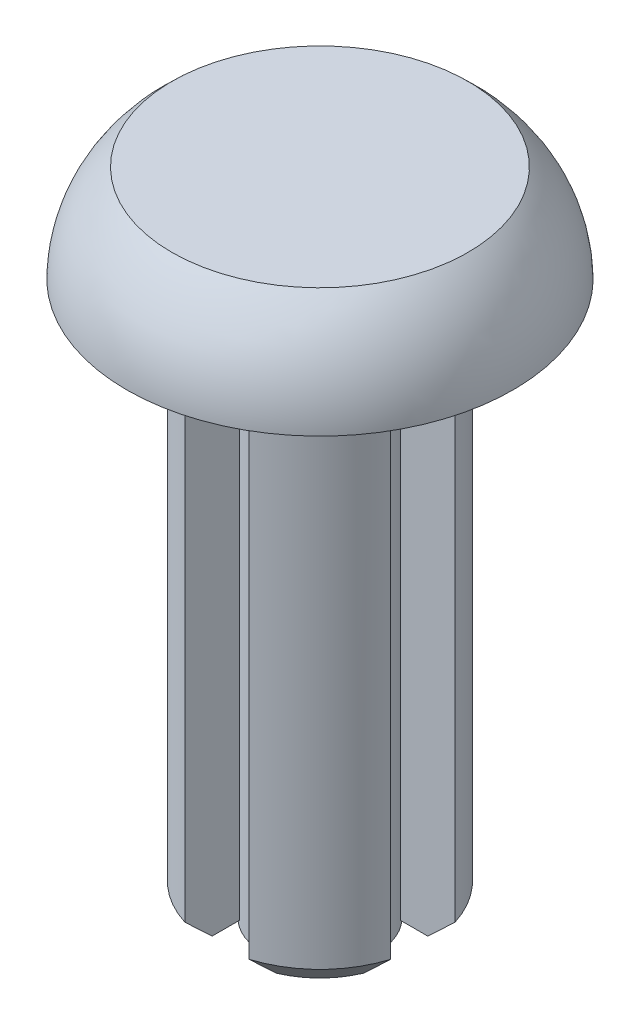
ISO-10303-21;
HEADER;
FILE_DESCRIPTION(('STEP AP214'),'2;1');
FILE_NAME('part.step','',(''),(''),'','','');
FILE_SCHEMA(('AUTOMOTIVE_DESIGN { 1 0 10303 214 1 1 1 1 }'));
ENDSEC;
DATA;
#1=APPLICATION_CONTEXT('core data for automotive mechanical design processes');
#2=APPLICATION_PROTOCOL_DEFINITION('international standard','automotive_design',2000,#1);
#3=PRODUCT_CONTEXT('',#1,'mechanical');
#4=PRODUCT('Part','Part','',(#3));
#5=PRODUCT_RELATED_PRODUCT_CATEGORY('part','',(#4));
#6=PRODUCT_DEFINITION_FORMATION('','',#4);
#7=PRODUCT_DEFINITION_CONTEXT('part definition',#1,'design');
#8=PRODUCT_DEFINITION('design','',#6,#7);
#9=PRODUCT_DEFINITION_SHAPE('','',#8);
#10=(LENGTH_UNIT() NAMED_UNIT(*) SI_UNIT(.MILLI.,.METRE.));
#11=(NAMED_UNIT(*) PLANE_ANGLE_UNIT() SI_UNIT($,.RADIAN.));
#12=(NAMED_UNIT(*) SI_UNIT($,.STERADIAN.) SOLID_ANGLE_UNIT());
#13=UNCERTAINTY_MEASURE_WITH_UNIT(LENGTH_MEASURE(1.E-05),#10,'distance_accuracy_value','');
#14=(GEOMETRIC_REPRESENTATION_CONTEXT(3) GLOBAL_UNCERTAINTY_ASSIGNED_CONTEXT((#13)) GLOBAL_UNIT_ASSIGNED_CONTEXT((#10,
#11,#12)) REPRESENTATION_CONTEXT('',''));
#15=CARTESIAN_POINT('',(0.,0.,0.));
#16=DIRECTION('',(0.,0.,1.));
#17=DIRECTION('',(1.,0.,0.));
#18=AXIS2_PLACEMENT_3D('',#15,#16,#17);
#19=CARTESIAN_POINT('',(0.,1.905,0.));
#20=DIRECTION('',(0.,1.,0.));
#21=DIRECTION('',(0.,0.,1.));
#22=AXIS2_PLACEMENT_3D('',#19,#20,#21);
#23=PLANE('',#22);
#24=CARTESIAN_POINT('',(0.,1.905,0.));
#25=DIRECTION('',(0.,1.,0.));
#26=DIRECTION('',(0.,0.,1.));
#27=AXIS2_PLACEMENT_3D('',#24,#25,#26);
#28=CIRCLE('',#27,2.921);
#29=CARTESIAN_POINT('',(0.,1.905,2.921));
#30=VERTEX_POINT('',#29);
#31=EDGE_CURVE('E21',#30,#30,#28,.F.);
#32=ORIENTED_EDGE('',*,*,#31,.F.);
#33=EDGE_LOOP('',(#32));
#34=FACE_BOUND('',#33,.T.);
#35=ADVANCED_FACE('F17',(#34),#23,.T.);
#36=CARTESIAN_POINT('',(0.,-11.4394,0.));
#37=DIRECTION('',(0.,-1.,0.));
#38=DIRECTION('',(0.,0.,-1.));
#39=AXIS2_PLACEMENT_3D('',#36,#37,#38);
#40=PLANE('',#39);
#41=CARTESIAN_POINT('',(0.,-11.4393999999152,0.));
#42=DIRECTION('',(0.,1.,0.));
#43=DIRECTION('',(0.,0.,1.));
#44=AXIS2_PLACEMENT_3D('',#41,#42,#43);
#45=CIRCLE('',#44,0.634999999988395);
#46=CARTESIAN_POINT('',(0.,-11.4393999999152,0.634999999988395));
#47=VERTEX_POINT('',#46);
#48=EDGE_CURVE('E174',#47,#47,#45,.T.);
#49=ORIENTED_EDGE('',*,*,#48,.F.);
#50=EDGE_LOOP('',(#49));
#51=FACE_BOUND('',#50,.T.);
#52=ADVANCED_FACE('F355',(#51),#40,.T.);
#53=CARTESIAN_POINT('',(0.,-10.8044,0.));
#54=DIRECTION('',(0.,-1.,0.));
#55=DIRECTION('',(0.,0.,-1.));
#56=AXIS2_PLACEMENT_3D('',#53,#54,#55);
#57=PLANE('',#56);
#58=DIRECTION('',(1.,0.,0.));
#59=VECTOR('',#58,1.);
#60=CARTESIAN_POINT('',(0.635,-10.8044,0.635));
#61=LINE('',#60,#59);
#62=CARTESIAN_POINT('',(0.950380976240581,-10.8044,0.635));
#63=VERTEX_POINT('',#62);
#64=CARTESIAN_POINT('',(1.48954542139407,-10.8043999999918,0.635));
#65=VERTEX_POINT('',#64);
#66=EDGE_CURVE('E189',#63,#65,#61,.T.);
#67=ORIENTED_EDGE('',*,*,#66,.T.);
#68=CARTESIAN_POINT('',(0.,-10.8043999999836,0.));
#69=DIRECTION('',(0.,1.,0.));
#70=DIRECTION('',(0.,0.,1.));
#71=AXIS2_PLACEMENT_3D('',#68,#69,#70);
#72=CIRCLE('',#71,1.61924999997609);
#73=CARTESIAN_POINT('',(0.635000000000001,-10.8043999999877,1.48954542139852));
#74=VERTEX_POINT('',#73);
#75=EDGE_CURVE('E190',#74,#65,#72,.T.);
#76=ORIENTED_EDGE('',*,*,#75,.F.);
#77=DIRECTION('',(0.,0.,-1.));
#78=VECTOR('',#77,1.);
#79=CARTESIAN_POINT('',(0.635000000000001,-10.8043999999918,2.03026292940102));
#80=LINE('',#79,#78);
#81=CARTESIAN_POINT('',(0.635,-10.8043999999959,0.950380976240581));
#82=VERTEX_POINT('',#81);
#83=EDGE_CURVE('E194',#74,#82,#80,.T.);
#84=ORIENTED_EDGE('',*,*,#83,.T.);
#85=CARTESIAN_POINT('',(0.,-10.8044,0.));
#86=DIRECTION('',(0.,1.,0.));
#87=DIRECTION('',(0.,0.,1.));
#88=AXIS2_PLACEMENT_3D('',#85,#86,#87);
#89=CIRCLE('',#88,1.143);
#90=EDGE_CURVE('E173',#63,#82,#89,.F.);
#91=ORIENTED_EDGE('',*,*,#90,.F.);
#92=EDGE_LOOP('',(#67,#76,#84,#91));
#93=FACE_BOUND('',#92,.T.);
#94=ADVANCED_FACE('F361',(#93),#57,.T.);
#95=CARTESIAN_POINT('',(0.,-10.8044,0.));
#96=DIRECTION('',(0.,-1.,0.));
#97=DIRECTION('',(0.,0.,-1.));
#98=AXIS2_PLACEMENT_3D('',#95,#96,#97);
#99=PLANE('',#98);
#100=DIRECTION('',(0.,0.,-1.));
#101=VECTOR('',#100,1.);
#102=CARTESIAN_POINT('',(0.635,-10.8044,-0.635));
#103=LINE('',#102,#101);
#104=CARTESIAN_POINT('',(0.635,-10.8044,-0.950380976240581));
#105=VERTEX_POINT('',#104);
#106=CARTESIAN_POINT('',(0.635000000000001,-10.8044000000202,-1.48954542130138));
#107=VERTEX_POINT('',#106);
#108=EDGE_CURVE('E300',#105,#107,#103,.T.);
#109=ORIENTED_EDGE('',*,*,#108,.T.);
#110=CARTESIAN_POINT('',(0.,-10.8044000000405,0.));
#111=DIRECTION('',(0.,1.,0.));
#112=DIRECTION('',(0.,0.,1.));
#113=AXIS2_PLACEMENT_3D('',#110,#111,#112);
#114=CIRCLE('',#113,1.6192499998624);
#115=CARTESIAN_POINT('',(1.48954542130583,-10.8044000000161,-0.635));
#116=VERTEX_POINT('',#115);
#117=EDGE_CURVE('E158',#116,#107,#114,.T.);
#118=ORIENTED_EDGE('',*,*,#117,.F.);
#119=DIRECTION('',(-1.,0.,0.));
#120=VECTOR('',#119,1.);
#121=CARTESIAN_POINT('',(0.635,-10.8043999999918,-0.635));
#122=LINE('',#121,#120);
#123=CARTESIAN_POINT('',(0.950380976240581,-10.8043999999959,-0.635));
#124=VERTEX_POINT('',#123);
#125=EDGE_CURVE('E152',#116,#124,#122,.T.);
#126=ORIENTED_EDGE('',*,*,#125,.T.);
#127=CARTESIAN_POINT('',(0.,-10.8044,0.));
#128=DIRECTION('',(0.,1.,0.));
#129=DIRECTION('',(0.,0.,1.));
#130=AXIS2_PLACEMENT_3D('',#127,#128,#129);
#131=CIRCLE('',#130,1.143);
#132=EDGE_CURVE('E155',#105,#124,#131,.F.);
#133=ORIENTED_EDGE('',*,*,#132,.F.);
#134=EDGE_LOOP('',(#109,#118,#126,#133));
#135=FACE_BOUND('',#134,.T.);
#136=ADVANCED_FACE('F154',(#135),#99,.T.);
#137=CARTESIAN_POINT('',(0.,-0.0595861521909713,0.));
#138=DIRECTION('',(0.,1.,0.));
#139=DIRECTION('',(0.,0.,1.));
#140=AXIS2_PLACEMENT_3D('',#137,#138,#139);
#141=DEGENERATE_TOROIDAL_SURFACE('',#140,1.19674395959077,2.61393527889813,.T.);
#142=ORIENTED_EDGE('',*,*,#31,.T.);
#143=EDGE_LOOP('',(#142));
#144=FACE_BOUND('',#143,.T.);
#145=CARTESIAN_POINT('',(0.,-1.77635683940025E-12,0.));
#146=DIRECTION('',(0.,1.,0.));
#147=DIRECTION('',(0.,0.,1.));
#148=AXIS2_PLACEMENT_3D('',#145,#146,#147);
#149=CIRCLE('',#148,3.80999999993037);
#150=CARTESIAN_POINT('',(0.,-1.77635683940025E-12,3.80999999993037));
#151=VERTEX_POINT('',#150);
#152=EDGE_CURVE('E299',#151,#151,#149,.F.);
#153=ORIENTED_EDGE('',*,*,#152,.F.);
#154=EDGE_LOOP('',(#153));
#155=FACE_BOUND('',#154,.T.);
#156=ADVANCED_FACE('F351',(#144,#155),#141,.T.);
#157=CARTESIAN_POINT('',(0.,-10.9314000000609,0.));
#158=DIRECTION('',(0.,1.,0.));
#159=DIRECTION('',(0.,0.,1.));
#160=AXIS2_PLACEMENT_3D('',#157,#158,#159);
#161=CONICAL_SURFACE('',#160,1.14299999984269,0.785398163397448);
#162=ORIENTED_EDGE('',*,*,#48,.T.);
#163=EDGE_LOOP('',(#162));
#164=FACE_BOUND('',#163,.T.);
#165=CARTESIAN_POINT('',(0.,-10.9314,0.));
#166=DIRECTION('',(0.,1.,0.));
#167=DIRECTION('',(0.,0.,1.));
#168=AXIS2_PLACEMENT_3D('',#165,#166,#167);
#169=CIRCLE('',#168,1.143);
#170=CARTESIAN_POINT('',(0.,-10.9314,1.143));
#171=VERTEX_POINT('',#170);
#172=EDGE_CURVE('E291',#171,#171,#169,.T.);
#173=ORIENTED_EDGE('',*,*,#172,.F.);
#174=EDGE_LOOP('',(#173));
#175=FACE_BOUND('',#174,.T.);
#176=ADVANCED_FACE('F398',(#164,#175),#161,.T.);
#177=CARTESIAN_POINT('',(0.635000000000001,-0.644399999999998,2.03026292940102));
#178=DIRECTION('',(1.,0.,0.));
#179=DIRECTION('',(0.,0.,-1.));
#180=AXIS2_PLACEMENT_3D('',#177,#178,#179);
#181=PLANE('',#180);
#182=DIRECTION('',(0.,1.,0.));
#183=VECTOR('',#182,1.);
#184=CARTESIAN_POINT('',(0.635000000000001,-10.8044,2.03026292940102));
#185=LINE('',#184,#183);
#186=CARTESIAN_POINT('',(0.635000000000001,-0.644399999999998,2.03026292940102));
#187=VERTEX_POINT('',#186);
#188=CARTESIAN_POINT('',(0.635000000000001,-10.2963999999786,2.0302629293955));
#189=VERTEX_POINT('',#188);
#190=EDGE_CURVE('E285',#187,#189,#185,.F.);
#191=ORIENTED_EDGE('',*,*,#190,.F.);
#192=DIRECTION('',(0.,0.,-1.));
#193=VECTOR('',#192,1.);
#194=CARTESIAN_POINT('',(0.635000000000001,-0.644399999999998,2.03026292940102));
#195=LINE('',#194,#193);
#196=CARTESIAN_POINT('',(0.635,-0.644399999999998,0.950380976240581));
#197=VERTEX_POINT('',#196);
#198=EDGE_CURVE('E193',#197,#187,#195,.F.);
#199=ORIENTED_EDGE('',*,*,#198,.F.);
#200=DIRECTION('',(0.,1.,0.));
#201=VECTOR('',#200,1.);
#202=CARTESIAN_POINT('',(0.635,-0.644399999999998,0.950380976240581));
#203=LINE('',#202,#201);
#204=EDGE_CURVE('E191',#82,#197,#203,.T.);
#205=ORIENTED_EDGE('',*,*,#204,.F.);
#206=ORIENTED_EDGE('',*,*,#83,.F.);
#207=CARTESIAN_POINT('',(0.635000000000001,-10.2963999999702,2.03026292938998));
#208=CARTESIAN_POINT('',(0.635000000000001,-10.3390858324227,1.98553535088397));
#209=CARTESIAN_POINT('',(0.635000000000001,-10.3817085821711,1.94074736694316));
#210=CARTESIAN_POINT('',(0.635000000000001,-10.4667920637127,1.85101953980214));
#211=CARTESIAN_POINT('',(0.635000000000001,-10.5092527987846,1.80607969971006));
#212=CARTESIAN_POINT('',(0.635000000000001,-10.5939784631017,1.71601494909392));
#213=CARTESIAN_POINT('',(0.635000000000001,-10.6362433908426,1.67089003715297));
#214=CARTESIAN_POINT('',(0.635000000000001,-10.720523173935,1.58040565286933));
#215=CARTESIAN_POINT('',(0.635000000000001,-10.7625380241531,1.53504617574705));
#216=CARTESIAN_POINT('',(0.635000000000001,-10.8043999999896,1.48954542139652));
#217=B_SPLINE_CURVE_WITH_KNOTS('',3,(#207,#208,#209,#210,#211,#212,#213,#214,#215,#216),
.UNSPECIFIED.,.F.,.F.,(4,2,2,2,4),(0.,0.185482565150804,0.370961356629227,0.556441570759836,
0.741925579312719),.UNSPECIFIED.);
#218=EDGE_CURVE('E338',#189,#74,#217,.T.);
#219=ORIENTED_EDGE('',*,*,#218,.F.);
#220=EDGE_LOOP('',(#191,#199,#205,#206,#219));
#221=FACE_BOUND('',#220,.T.);
#222=ADVANCED_FACE('F333',(#221),#181,.F.);
#223=CARTESIAN_POINT('',(0.,-10.2964000000156,0.));
#224=DIRECTION('',(0.,1.,0.));
#225=DIRECTION('',(0.,0.,1.));
#226=AXIS2_PLACEMENT_3D('',#223,#224,#225);
#227=CONICAL_SURFACE('',#226,2.12724999994407,0.785398163397448);
#228=CARTESIAN_POINT('',(1.48954542139489,-10.8043999999911,0.635));
#229=CARTESIAN_POINT('',(1.53504617574504,-10.762538024155,0.635));
#230=CARTESIAN_POINT('',(1.58040565286695,-10.7205231739372,0.635));
#231=CARTESIAN_POINT('',(1.67089003714985,-10.6362433908455,0.635));
#232=CARTESIAN_POINT('',(1.71601494909043,-10.5939784631049,0.635));
#233=CARTESIAN_POINT('',(1.80607969970584,-10.5092527987886,0.635));
#234=CARTESIAN_POINT('',(1.85101953979754,-10.4667920637171,0.635));
#235=CARTESIAN_POINT('',(1.94074736693783,-10.3817085821762,0.635));
#236=CARTESIAN_POINT('',(1.98553535087827,-10.3390858324281,0.635));
#237=CARTESIAN_POINT('',(2.03026292938392,-10.296399999976,0.635));
#238=B_SPLINE_CURVE_WITH_KNOTS('',3,(#228,#229,#230,#231,#232,#233,#234,#235,#236,#237),
.UNSPECIFIED.,.F.,.F.,(4,2,2,2,4),(0.,0.185484008551341,0.37096422268041,0.55644301415729,
0.741925579306553),.UNSPECIFIED.);
#239=CARTESIAN_POINT('',(2.03026292939202,-10.2963999999815,0.635000000001433));
#240=VERTEX_POINT('',#239);
#241=EDGE_CURVE('E319',#65,#240,#238,.T.);
#242=ORIENTED_EDGE('',*,*,#241,.T.);
#243=CARTESIAN_POINT('',(0.,-10.296399999987,0.));
#244=DIRECTION('',(0.,1.,0.));
#245=DIRECTION('',(0.,0.,1.));
#246=AXIS2_PLACEMENT_3D('',#243,#244,#245);
#247=CIRCLE('',#246,2.12725);
#248=EDGE_CURVE('E423',#189,#240,#247,.T.);
#249=ORIENTED_EDGE('',*,*,#248,.F.);
#250=ORIENTED_EDGE('',*,*,#218,.T.);
#251=ORIENTED_EDGE('',*,*,#75,.T.);
#252=EDGE_LOOP('',(#242,#249,#250,#251));
#253=FACE_BOUND('',#252,.T.);
#254=ADVANCED_FACE('F329',(#253),#227,.T.);
#255=CARTESIAN_POINT('',(0.635,-0.644399999999998,0.635));
#256=DIRECTION('',(0.,0.,1.));
#257=DIRECTION('',(1.,0.,0.));
#258=AXIS2_PLACEMENT_3D('',#255,#256,#257);
#259=PLANE('',#258);
#260=ORIENTED_EDGE('',*,*,#66,.F.);
#261=DIRECTION('',(0.,1.,0.));
#262=VECTOR('',#261,1.);
#263=CARTESIAN_POINT('',(0.950380976240581,-0.644399999999998,0.635));
#264=LINE('',#263,#262);
#265=CARTESIAN_POINT('',(0.950380976240581,-0.644399999999998,0.635));
#266=VERTEX_POINT('',#265);
#267=EDGE_CURVE('E186',#266,#63,#264,.F.);
#268=ORIENTED_EDGE('',*,*,#267,.F.);
#269=DIRECTION('',(1.,0.,0.));
#270=VECTOR('',#269,1.);
#271=CARTESIAN_POINT('',(0.,-0.644399999999998,0.635));
#272=LINE('',#271,#270);
#273=CARTESIAN_POINT('',(2.03026292940057,-0.644399999999998,0.635000000001433));
#274=VERTEX_POINT('',#273);
#275=EDGE_CURVE('E318',#274,#266,#272,.F.);
#276=ORIENTED_EDGE('',*,*,#275,.F.);
#277=DIRECTION('',(0.,1.,0.));
#278=VECTOR('',#277,1.);
#279=CARTESIAN_POINT('',(2.03026292940012,-10.8044,0.635000000002867));
#280=LINE('',#279,#278);
#281=EDGE_CURVE('E281',#240,#274,#280,.T.);
#282=ORIENTED_EDGE('',*,*,#281,.F.);
#283=ORIENTED_EDGE('',*,*,#241,.F.);
#284=EDGE_LOOP('',(#260,#268,#276,#282,#283));
#285=FACE_BOUND('',#284,.T.);
#286=ADVANCED_FACE('F327',(#285),#259,.F.);
#287=CARTESIAN_POINT('',(0.,-0.644399999999998,0.));
#288=DIRECTION('',(0.,-1.,0.));
#289=DIRECTION('',(0.,0.,-1.));
#290=AXIS2_PLACEMENT_3D('',#287,#288,#289);
#291=PLANE('',#290);
#292=ORIENTED_EDGE('',*,*,#275,.T.);
#293=CARTESIAN_POINT('',(0.,-0.644399999999998,0.));
#294=DIRECTION('',(0.,1.,0.));
#295=DIRECTION('',(0.,0.,1.));
#296=AXIS2_PLACEMENT_3D('',#293,#294,#295);
#297=CIRCLE('',#296,1.143);
#298=CARTESIAN_POINT('',(0.950380976240581,-0.644399999999998,-0.635));
#299=VERTEX_POINT('',#298);
#300=EDGE_CURVE('E163',#266,#299,#297,.T.);
#301=ORIENTED_EDGE('',*,*,#300,.T.);
#302=DIRECTION('',(-1.,0.,0.));
#303=VECTOR('',#302,1.);
#304=CARTESIAN_POINT('',(0.635,-0.644399999999998,-0.635));
#305=LINE('',#304,#303);
#306=CARTESIAN_POINT('',(2.03026292940102,-0.644399999999998,-0.635));
#307=VERTEX_POINT('',#306);
#308=EDGE_CURVE('E179',#299,#307,#305,.F.);
#309=ORIENTED_EDGE('',*,*,#308,.T.);
#310=CARTESIAN_POINT('',(0.,-0.644399999999998,0.));
#311=DIRECTION('',(0.,1.,0.));
#312=DIRECTION('',(0.,0.,1.));
#313=AXIS2_PLACEMENT_3D('',#310,#311,#312);
#314=CIRCLE('',#313,2.12725);
#315=EDGE_CURVE('E277',#274,#307,#314,.T.);
#316=ORIENTED_EDGE('',*,*,#315,.F.);
#317=EDGE_LOOP('',(#292,#301,#309,#316));
#318=FACE_BOUND('',#317,.T.);
#319=ADVANCED_FACE('F508',(#318),#291,.T.);
#320=CARTESIAN_POINT('',(0.635,-0.644399999999998,-0.635));
#321=DIRECTION('',(0.,0.,-1.));
#322=DIRECTION('',(-1.,0.,0.));
#323=AXIS2_PLACEMENT_3D('',#320,#321,#322);
#324=PLANE('',#323);
#325=DIRECTION('',(0.,1.,0.));
#326=VECTOR('',#325,1.);
#327=CARTESIAN_POINT('',(2.03026292940102,-10.8044,-0.635));
#328=LINE('',#327,#326);
#329=CARTESIAN_POINT('',(2.03026292938663,-10.2963999999512,-0.635));
#330=VERTEX_POINT('',#329);
#331=EDGE_CURVE('E280',#307,#330,#328,.F.);
#332=ORIENTED_EDGE('',*,*,#331,.F.);
#333=ORIENTED_EDGE('',*,*,#308,.F.);
#334=DIRECTION('',(0.,1.,0.));
#335=VECTOR('',#334,1.);
#336=CARTESIAN_POINT('',(0.950380976240581,-0.644399999999998,-0.635));
#337=LINE('',#336,#335);
#338=EDGE_CURVE('E162',#124,#299,#337,.T.);
#339=ORIENTED_EDGE('',*,*,#338,.F.);
#340=ORIENTED_EDGE('',*,*,#125,.F.);
#341=CARTESIAN_POINT('',(2.03026292937224,-10.2963999999303,-0.635));
#342=CARTESIAN_POINT('',(1.98553535086077,-10.3390858323879,-0.635));
#343=CARTESIAN_POINT('',(1.94074736691449,-10.3817085821415,-0.635));
#344=CARTESIAN_POINT('',(1.85101953976248,-10.4667920636934,-0.635));
#345=CARTESIAN_POINT('',(1.80607969966489,-10.5092527987704,-0.635));
#346=CARTESIAN_POINT('',(1.71601494903765,-10.5939784630976,-0.635));
#347=CARTESIAN_POINT('',(1.67089003709113,-10.6362433908435,-0.635));
#348=CARTESIAN_POINT('',(1.58040565279625,-10.720523173946,-0.635));
#349=CARTESIAN_POINT('',(1.53504617566831,-10.7625380241691,-0.635));
#350=CARTESIAN_POINT('',(1.48954542131207,-10.8044000000104,-0.635));
#351=B_SPLINE_CURVE_WITH_KNOTS('',3,(#341,#342,#343,#344,#345,#346,#347,#348,#349,#350),
.UNSPECIFIED.,.F.,.F.,(4,2,2,2,4),(0.,0.185482565173361,0.370961356674336,0.5564415708275,
0.741925579402941),.UNSPECIFIED.);
#352=EDGE_CURVE('E181',#330,#116,#351,.T.);
#353=ORIENTED_EDGE('',*,*,#352,.F.);
#354=EDGE_LOOP('',(#332,#333,#339,#340,#353));
#355=FACE_BOUND('',#354,.T.);
#356=ADVANCED_FACE('F178',(#355),#324,.F.);
#357=CARTESIAN_POINT('',(0.,-10.2963999999588,0.));
#358=DIRECTION('',(0.,1.,0.));
#359=DIRECTION('',(0.,0.,1.));
#360=AXIS2_PLACEMENT_3D('',#357,#358,#359);
#361=CONICAL_SURFACE('',#360,2.12724999994407,0.785398163397448);
#362=CARTESIAN_POINT('',(0.635000000000001,-10.8044000000015,-1.48954542132177));
#363=CARTESIAN_POINT('',(0.635000000000001,-10.7625380241619,-1.53504617567605));
#364=CARTESIAN_POINT('',(0.635000000000001,-10.7205231739406,-1.58040565280204));
#365=CARTESIAN_POINT('',(0.635000000000001,-10.6362433908417,-1.67089003709305));
#366=CARTESIAN_POINT('',(0.635000000000001,-10.5939784630976,-1.71601494903765));
#367=CARTESIAN_POINT('',(0.635000000000001,-10.509252798774,-1.80607969966106));
#368=CARTESIAN_POINT('',(0.635000000000001,-10.4667920636988,-1.85101953975675));
#369=CARTESIAN_POINT('',(0.635000000000001,-10.3817085821506,-1.94074736690495));
#370=CARTESIAN_POINT('',(0.635000000000001,-10.3390858323988,-1.98553535084933));
#371=CARTESIAN_POINT('',(0.635000000000001,-10.2963999999431,-2.03026292935891));
#372=B_SPLINE_CURVE_WITH_KNOTS('',3,(#362,#363,#364,#365,#366,#367,#368,#369,#370,#371),
.UNSPECIFIED.,.F.,.F.,(4,2,2,2,4),(0.,0.185484008567538,0.370964222712802,0.556443014205879,
0.74192557937134),.UNSPECIFIED.);
#373=CARTESIAN_POINT('',(0.635000000003457,-10.2963999999576,-2.03026292937888));
#374=VERTEX_POINT('',#373);
#375=EDGE_CURVE('E292',#107,#374,#372,.T.);
#376=ORIENTED_EDGE('',*,*,#375,.T.);
#377=CARTESIAN_POINT('',(0.,-10.2963999999721,0.));
#378=DIRECTION('',(0.,1.,0.));
#379=DIRECTION('',(0.,0.,1.));
#380=AXIS2_PLACEMENT_3D('',#377,#378,#379);
#381=CIRCLE('',#380,2.12725);
#382=EDGE_CURVE('E430',#330,#374,#381,.T.);
#383=ORIENTED_EDGE('',*,*,#382,.F.);
#384=ORIENTED_EDGE('',*,*,#352,.T.);
#385=ORIENTED_EDGE('',*,*,#117,.T.);
#386=EDGE_LOOP('',(#376,#383,#384,#385));
#387=FACE_BOUND('',#386,.T.);
#388=ADVANCED_FACE('F305',(#387),#361,.T.);
#389=CARTESIAN_POINT('',(0.635,-0.644399999999998,-0.635));
#390=DIRECTION('',(1.,0.,0.));
#391=DIRECTION('',(0.,0.,-1.));
#392=AXIS2_PLACEMENT_3D('',#389,#390,#391);
#393=PLANE('',#392);
#394=ORIENTED_EDGE('',*,*,#108,.F.);
#395=DIRECTION('',(0.,1.,0.));
#396=VECTOR('',#395,1.);
#397=CARTESIAN_POINT('',(0.635,-0.644399999999998,-0.950380976240581));
#398=LINE('',#397,#396);
#399=CARTESIAN_POINT('',(0.635,-0.644399999999998,-0.950380976240581));
#400=VERTEX_POINT('',#399);
#401=EDGE_CURVE('E171',#400,#105,#398,.F.);
#402=ORIENTED_EDGE('',*,*,#401,.F.);
#403=DIRECTION('',(0.,0.,-1.));
#404=VECTOR('',#403,1.);
#405=CARTESIAN_POINT('',(0.635,-0.644399999999998,-0.635));
#406=LINE('',#405,#404);
#407=CARTESIAN_POINT('',(0.635000000003457,-0.644399999999998,-2.03026292939994));
#408=VERTEX_POINT('',#407);
#409=EDGE_CURVE('E431',#408,#400,#406,.F.);
#410=ORIENTED_EDGE('',*,*,#409,.F.);
#411=DIRECTION('',(0.,1.,0.));
#412=VECTOR('',#411,1.);
#413=CARTESIAN_POINT('',(0.635000000006913,-10.8044,-2.03026292939886));
#414=LINE('',#413,#412);
#415=EDGE_CURVE('E436',#374,#408,#414,.T.);
#416=ORIENTED_EDGE('',*,*,#415,.F.);
#417=ORIENTED_EDGE('',*,*,#375,.F.);
#418=EDGE_LOOP('',(#394,#402,#410,#416,#417));
#419=FACE_BOUND('',#418,.T.);
#420=ADVANCED_FACE('F302',(#419),#393,.F.);
#421=CARTESIAN_POINT('',(0.,-1.77635683940025E-12,0.));
#422=DIRECTION('',(0.,1.,0.));
#423=DIRECTION('',(0.,0.,1.));
#424=AXIS2_PLACEMENT_3D('',#421,#422,#423);
#425=CONICAL_SURFACE('',#424,3.80999999987353,1.54799877919653);
#426=ORIENTED_EDGE('',*,*,#152,.T.);
#427=EDGE_LOOP('',(#426));
#428=FACE_BOUND('',#427,.T.);
#429=CARTESIAN_POINT('',(0.,-0.0227955728942452,0.));
#430=DIRECTION('',(0.,1.,0.));
#431=DIRECTION('',(-1.,0.,0.));
#432=AXIS2_PLACEMENT_3D('',#429,#430,#431);
#433=CIRCLE('',#432,2.81025985283353);
#434=CARTESIAN_POINT('',(-2.81025985283353,-0.0227955728942452,0.));
#435=VERTEX_POINT('',#434);
#436=EDGE_CURVE('E276',#435,#435,#433,.T.);
#437=ORIENTED_EDGE('',*,*,#436,.T.);
#438=EDGE_LOOP('',(#437));
#439=FACE_BOUND('',#438,.T.);
#440=ADVANCED_FACE('F395',(#428,#439),#425,.T.);
#441=CARTESIAN_POINT('',(0.,-10.8044,0.));
#442=DIRECTION('',(0.,-1.,0.));
#443=DIRECTION('',(0.,0.,-1.));
#444=AXIS2_PLACEMENT_3D('',#441,#442,#443);
#445=PLANE('',#444);
#446=DIRECTION('',(-1.,0.,0.));
#447=VECTOR('',#446,1.);
#448=CARTESIAN_POINT('',(-2.03026292940102,-10.8044,-0.635));
#449=LINE('',#448,#447);
#450=CARTESIAN_POINT('',(-0.950380976240581,-10.8044,-0.635));
#451=VERTEX_POINT('',#450);
#452=CARTESIAN_POINT('',(-1.48954542136318,-10.8043999999634,-0.635));
#453=VERTEX_POINT('',#452);
#454=EDGE_CURVE('E251',#451,#453,#449,.T.);
#455=ORIENTED_EDGE('',*,*,#454,.T.);
#456=CARTESIAN_POINT('',(0.,-10.8043999999268,0.));
#457=DIRECTION('',(0.,1.,0.));
#458=DIRECTION('',(0.,0.,1.));
#459=AXIS2_PLACEMENT_3D('',#456,#457,#458);
#460=CIRCLE('',#459,1.61924999997609);
#461=CARTESIAN_POINT('',(-0.635,-10.8043999999451,-1.48954542138308));
#462=VERTEX_POINT('',#461);
#463=EDGE_CURVE('E252',#462,#453,#460,.T.);
#464=ORIENTED_EDGE('',*,*,#463,.F.);
#465=DIRECTION('',(0.,0.,1.));
#466=VECTOR('',#465,1.);
#467=CARTESIAN_POINT('',(-0.635,-10.8043999999634,-0.635));
#468=LINE('',#467,#466);
#469=CARTESIAN_POINT('',(-0.635,-10.8043999999817,-0.950380976240581));
#470=VERTEX_POINT('',#469);
#471=EDGE_CURVE('E275',#462,#470,#468,.T.);
#472=ORIENTED_EDGE('',*,*,#471,.T.);
#473=CARTESIAN_POINT('',(0.,-10.8044,0.));
#474=DIRECTION('',(0.,1.,0.));
#475=DIRECTION('',(0.,0.,1.));
#476=AXIS2_PLACEMENT_3D('',#473,#474,#475);
#477=CIRCLE('',#476,1.143);
#478=EDGE_CURVE('E286',#451,#470,#477,.F.);
#479=ORIENTED_EDGE('',*,*,#478,.F.);
#480=EDGE_LOOP('',(#455,#464,#472,#479));
#481=FACE_BOUND('',#480,.T.);
#482=ADVANCED_FACE('F568',(#481),#445,.T.);
#483=CARTESIAN_POINT('',(0.,-11.4394,0.));
#484=DIRECTION('',(0.,1.,0.));
#485=DIRECTION('',(0.,0.,1.));
#486=AXIS2_PLACEMENT_3D('',#483,#484,#485);
#487=CYLINDRICAL_SURFACE('',#486,1.143);
#488=ORIENTED_EDGE('',*,*,#172,.T.);
#489=EDGE_LOOP('',(#488));
#490=FACE_BOUND('',#489,.T.);
#491=DIRECTION('',(0.,1.,0.));
#492=VECTOR('',#491,1.);
#493=CARTESIAN_POINT('',(-0.635,-0.644399999999998,-0.950380976240581));
#494=LINE('',#493,#492);
#495=CARTESIAN_POINT('',(-0.635,-0.644399999999998,-0.950380976240581));
#496=VERTEX_POINT('',#495);
#497=EDGE_CURVE('E442',#470,#496,#494,.T.);
#498=ORIENTED_EDGE('',*,*,#497,.T.);
#499=CARTESIAN_POINT('',(0.,-0.644399999999998,0.));
#500=DIRECTION('',(0.,1.,0.));
#501=DIRECTION('',(0.,0.,1.));
#502=AXIS2_PLACEMENT_3D('',#499,#500,#501);
#503=CIRCLE('',#502,1.143);
#504=EDGE_CURVE('E272',#400,#496,#503,.T.);
#505=ORIENTED_EDGE('',*,*,#504,.F.);
#506=ORIENTED_EDGE('',*,*,#401,.T.);
#507=ORIENTED_EDGE('',*,*,#132,.T.);
#508=ORIENTED_EDGE('',*,*,#338,.T.);
#509=ORIENTED_EDGE('',*,*,#300,.F.);
#510=ORIENTED_EDGE('',*,*,#267,.T.);
#511=ORIENTED_EDGE('',*,*,#90,.T.);
#512=ORIENTED_EDGE('',*,*,#204,.T.);
#513=CARTESIAN_POINT('',(0.,-0.644399999999998,0.));
#514=DIRECTION('',(0.,1.,0.));
#515=DIRECTION('',(0.,0.,1.));
#516=AXIS2_PLACEMENT_3D('',#513,#514,#515);
#517=CIRCLE('',#516,1.143);
#518=CARTESIAN_POINT('',(-0.635,-0.644399999999998,0.950380976240581));
#519=VERTEX_POINT('',#518);
#520=EDGE_CURVE('E289',#197,#519,#517,.F.);
#521=ORIENTED_EDGE('',*,*,#520,.T.);
#522=DIRECTION('',(0.,1.,0.));
#523=VECTOR('',#522,1.);
#524=CARTESIAN_POINT('',(-0.635,-0.644399999999998,0.950380976240581));
#525=LINE('',#524,#523);
#526=CARTESIAN_POINT('',(-0.635,-10.8044,0.950380976240581));
#527=VERTEX_POINT('',#526);
#528=EDGE_CURVE('E449',#519,#527,#525,.F.);
#529=ORIENTED_EDGE('',*,*,#528,.T.);
#530=CARTESIAN_POINT('',(0.,-10.8044,0.));
#531=DIRECTION('',(0.,1.,0.));
#532=DIRECTION('',(0.,0.,1.));
#533=AXIS2_PLACEMENT_3D('',#530,#531,#532);
#534=CIRCLE('',#533,1.143);
#535=CARTESIAN_POINT('',(-0.950380976240581,-10.8043999999959,0.635));
#536=VERTEX_POINT('',#535);
#537=EDGE_CURVE('E282',#536,#527,#534,.T.);
#538=ORIENTED_EDGE('',*,*,#537,.F.);
#539=DIRECTION('',(0.,1.,0.));
#540=VECTOR('',#539,1.);
#541=CARTESIAN_POINT('',(-0.950380976240581,-0.644399999999998,0.635));
#542=LINE('',#541,#540);
#543=CARTESIAN_POINT('',(-0.950380976240581,-0.644399999999998,0.635));
#544=VERTEX_POINT('',#543);
#545=EDGE_CURVE('E447',#536,#544,#542,.T.);
#546=ORIENTED_EDGE('',*,*,#545,.T.);
#547=CARTESIAN_POINT('',(0.,-0.644399999999998,0.));
#548=DIRECTION('',(0.,1.,0.));
#549=DIRECTION('',(0.,0.,1.));
#550=AXIS2_PLACEMENT_3D('',#547,#548,#549);
#551=CIRCLE('',#550,1.143);
#552=CARTESIAN_POINT('',(-0.950380976240581,-0.644399999999998,-0.635));
#553=VERTEX_POINT('',#552);
#554=EDGE_CURVE('E239',#553,#544,#551,.T.);
#555=ORIENTED_EDGE('',*,*,#554,.F.);
#556=DIRECTION('',(0.,1.,0.));
#557=VECTOR('',#556,1.);
#558=CARTESIAN_POINT('',(-0.950380976240581,-0.644399999999998,-0.635));
#559=LINE('',#558,#557);
#560=EDGE_CURVE('E444',#553,#451,#559,.F.);
#561=ORIENTED_EDGE('',*,*,#560,.T.);
#562=ORIENTED_EDGE('',*,*,#478,.T.);
#563=EDGE_LOOP('',(#498,#505,#506,#507,#508,#509,#510,#511,#512,#521,#529,#538,#546,#555,#561,#562));
#564=FACE_BOUND('',#563,.T.);
#565=ADVANCED_FACE('F166',(#490,#564),#487,.T.);
#566=CARTESIAN_POINT('',(0.,-10.8044,0.));
#567=DIRECTION('',(0.,-1.,0.));
#568=DIRECTION('',(0.,0.,-1.));
#569=AXIS2_PLACEMENT_3D('',#566,#567,#568);
#570=PLANE('',#569);
#571=DIRECTION('',(0.,0.,1.));
#572=VECTOR('',#571,1.);
#573=CARTESIAN_POINT('',(-0.634999999999999,-10.8044,2.03026292940102));
#574=LINE('',#573,#572);
#575=CARTESIAN_POINT('',(-0.635,-10.8043999999918,1.48954542145586));
#576=VERTEX_POINT('',#575);
#577=EDGE_CURVE('E217',#527,#576,#574,.T.);
#578=ORIENTED_EDGE('',*,*,#577,.T.);
#579=CARTESIAN_POINT('',(0.,-10.8043999999836,0.));
#580=DIRECTION('',(0.,1.,0.));
#581=DIRECTION('',(0.,0.,1.));
#582=AXIS2_PLACEMENT_3D('',#579,#580,#581);
#583=CIRCLE('',#582,1.61925000003293);
#584=CARTESIAN_POINT('',(-1.48954542146032,-10.8043999999877,0.635));
#585=VERTEX_POINT('',#584);
#586=EDGE_CURVE('E218',#585,#576,#583,.T.);
#587=ORIENTED_EDGE('',*,*,#586,.F.);
#588=DIRECTION('',(1.,0.,0.));
#589=VECTOR('',#588,1.);
#590=CARTESIAN_POINT('',(-2.03026292940102,-10.8043999999918,0.635));
#591=LINE('',#590,#589);
#592=EDGE_CURVE('E242',#585,#536,#591,.T.);
#593=ORIENTED_EDGE('',*,*,#592,.T.);
#594=ORIENTED_EDGE('',*,*,#537,.T.);
#595=EDGE_LOOP('',(#578,#587,#593,#594));
#596=FACE_BOUND('',#595,.T.);
#597=ADVANCED_FACE('F480',(#596),#570,.T.);
#598=CARTESIAN_POINT('',(0.,-0.0595861521909678,0.));
#599=DIRECTION('',(0.,1.,0.));
#600=DIRECTION('',(0.,0.,1.));
#601=AXIS2_PLACEMENT_3D('',#598,#599,#600);
#602=DEGENERATE_TOROIDAL_SURFACE('',#601,1.19674395959078,1.61393527889812,.T.);
#603=ORIENTED_EDGE('',*,*,#436,.F.);
#604=EDGE_LOOP('',(#603));
#605=FACE_BOUND('',#604,.T.);
#606=CARTESIAN_POINT('',(0.,0.905,0.));
#607=DIRECTION('',(0.,1.,0.));
#608=DIRECTION('',(0.,0.,1.));
#609=AXIS2_PLACEMENT_3D('',#606,#607,#608);
#610=CIRCLE('',#609,2.49071484004883);
#611=CARTESIAN_POINT('',(0.,0.905,2.49071484004883));
#612=VERTEX_POINT('',#611);
#613=EDGE_CURVE('E207',#612,#612,#610,.T.);
#614=ORIENTED_EDGE('',*,*,#613,.T.);
#615=EDGE_LOOP('',(#614));
#616=FACE_BOUND('',#615,.T.);
#617=ADVANCED_FACE('F19',(#605,#616),#602,.F.);
#618=CARTESIAN_POINT('',(0.,-0.644399999999998,0.));
#619=DIRECTION('',(0.,-1.,0.));
#620=DIRECTION('',(0.,0.,-1.));
#621=AXIS2_PLACEMENT_3D('',#618,#619,#620);
#622=PLANE('',#621);
#623=DIRECTION('',(0.,0.,1.));
#624=VECTOR('',#623,1.);
#625=CARTESIAN_POINT('',(-0.635,-0.644399999999998,-0.635));
#626=LINE('',#625,#624);
#627=CARTESIAN_POINT('',(-0.634999999999999,-0.644399999999998,-2.03026292940102));
#628=VERTEX_POINT('',#627);
#629=EDGE_CURVE('E271',#496,#628,#626,.F.);
#630=ORIENTED_EDGE('',*,*,#629,.T.);
#631=CARTESIAN_POINT('',(0.,-0.644399999999998,0.));
#632=DIRECTION('',(0.,1.,0.));
#633=DIRECTION('',(0.,0.,1.));
#634=AXIS2_PLACEMENT_3D('',#631,#632,#633);
#635=CIRCLE('',#634,2.12725);
#636=EDGE_CURVE('E203',#408,#628,#635,.T.);
#637=ORIENTED_EDGE('',*,*,#636,.F.);
#638=ORIENTED_EDGE('',*,*,#409,.T.);
#639=ORIENTED_EDGE('',*,*,#504,.T.);
#640=EDGE_LOOP('',(#630,#637,#638,#639));
#641=FACE_BOUND('',#640,.T.);
#642=ADVANCED_FACE('F501',(#641),#622,.T.);
#643=CARTESIAN_POINT('',(-0.635,-0.644399999999998,-0.635));
#644=DIRECTION('',(-1.,0.,0.));
#645=DIRECTION('',(0.,0.,1.));
#646=AXIS2_PLACEMENT_3D('',#643,#644,#645);
#647=PLANE('',#646);
#648=DIRECTION('',(0.,1.,0.));
#649=VECTOR('',#648,1.);
#650=CARTESIAN_POINT('',(-0.634999999999999,-10.8044,-2.03026292940102));
#651=LINE('',#650,#649);
#652=CARTESIAN_POINT('',(-0.634999999999999,-10.2963999999537,-2.03026292938574));
#653=VERTEX_POINT('',#652);
#654=EDGE_CURVE('E206',#628,#653,#651,.F.);
#655=ORIENTED_EDGE('',*,*,#654,.F.);
#656=ORIENTED_EDGE('',*,*,#629,.F.);
#657=ORIENTED_EDGE('',*,*,#497,.F.);
#658=ORIENTED_EDGE('',*,*,#471,.F.);
#659=CARTESIAN_POINT('',(-0.634999999999999,-10.296399999932,-2.03026292937046));
#660=CARTESIAN_POINT('',(-0.634999999999999,-10.3390858323847,-1.98553535086422));
#661=CARTESIAN_POINT('',(-0.634999999999999,-10.3817085821333,-1.94074736692319));
#662=CARTESIAN_POINT('',(-0.634999999999999,-10.4667920636752,-1.8510195397817));
#663=CARTESIAN_POINT('',(-0.634999999999999,-10.5092527987472,-1.80607969968939));
#664=CARTESIAN_POINT('',(-0.634999999999999,-10.5939784630647,-1.71601494907277));
#665=CARTESIAN_POINT('',(-0.635,-10.6362433908057,-1.67089003713158));
#666=CARTESIAN_POINT('',(-0.635,-10.7205231738985,-1.58040565284744));
#667=CARTESIAN_POINT('',(-0.635,-10.7625380241167,-1.53504617572491));
#668=CARTESIAN_POINT('',(-0.635,-10.8043999999533,-1.48954542137412));
#669=B_SPLINE_CURVE_WITH_KNOTS('',3,(#659,#660,#661,#662,#663,#664,#665,#666,#667,#668),
.UNSPECIFIED.,.F.,.F.,(4,2,2,2,4),(0.,0.185482565151669,0.370961356630953,0.556441570762427,
0.741925579316174),.UNSPECIFIED.);
#670=EDGE_CURVE('E265',#653,#462,#669,.T.);
#671=ORIENTED_EDGE('',*,*,#670,.F.);
#672=EDGE_LOOP('',(#655,#656,#657,#658,#671));
#673=FACE_BOUND('',#672,.T.);
#674=ADVANCED_FACE('F260',(#673),#647,.F.);
#675=CARTESIAN_POINT('',(0.,-10.2963999999588,0.));
#676=DIRECTION('',(0.,1.,0.));
#677=DIRECTION('',(0.,0.,1.));
#678=AXIS2_PLACEMENT_3D('',#675,#676,#677);
#679=CONICAL_SURFACE('',#678,2.12724999994407,0.785398163397448);
#680=CARTESIAN_POINT('',(-1.48954542136682,-10.80439999996,-0.635));
#681=CARTESIAN_POINT('',(-1.53504617571718,-10.7625380241239,-0.635));
#682=CARTESIAN_POINT('',(-1.58040565283929,-10.720523173906,-0.635));
#683=CARTESIAN_POINT('',(-1.67089003712257,-10.6362433908141,-0.635));
#684=CARTESIAN_POINT('',(-1.71601494906334,-10.5939784630735,-0.635));
#685=CARTESIAN_POINT('',(-1.80607969967911,-10.5092527987569,-0.635));
#686=CARTESIAN_POINT('',(-1.851019539771,-10.4667920636854,-0.635));
#687=CARTESIAN_POINT('',(-1.94074736691164,-10.3817085821442,-0.635));
#688=CARTESIAN_POINT('',(-1.98553535085225,-10.3390858323961,-0.635));
#689=CARTESIAN_POINT('',(-2.03026292935806,-10.2963999999439,-0.635));
#690=B_SPLINE_CURVE_WITH_KNOTS('',3,(#680,#681,#682,#683,#684,#685,#686,#687,#688,#689),
.UNSPECIFIED.,.F.,.F.,(4,2,2,2,4),(0.,0.185484008551938,0.370964222681605,0.556443014159085,
0.741925579308946),.UNSPECIFIED.);
#691=CARTESIAN_POINT('',(-2.03026292937846,-10.2963999999597,-0.635000000003456));
#692=VERTEX_POINT('',#691);
#693=EDGE_CURVE('E244',#453,#692,#690,.T.);
#694=ORIENTED_EDGE('',*,*,#693,.T.);
#695=CARTESIAN_POINT('',(0.,-10.2963999999755,0.));
#696=DIRECTION('',(0.,1.,0.));
#697=DIRECTION('',(0.,0.,1.));
#698=AXIS2_PLACEMENT_3D('',#695,#696,#697);
#699=CIRCLE('',#698,2.12725);
#700=EDGE_CURVE('E455',#653,#692,#699,.T.);
#701=ORIENTED_EDGE('',*,*,#700,.F.);
#702=ORIENTED_EDGE('',*,*,#670,.T.);
#703=ORIENTED_EDGE('',*,*,#463,.T.);
#704=EDGE_LOOP('',(#694,#701,#702,#703));
#705=FACE_BOUND('',#704,.T.);
#706=ADVANCED_FACE('F256',(#705),#679,.T.);
#707=CARTESIAN_POINT('',(-2.03026292940102,-0.644399999999998,-0.635));
#708=DIRECTION('',(0.,0.,-1.));
#709=DIRECTION('',(-1.,0.,0.));
#710=AXIS2_PLACEMENT_3D('',#707,#708,#709);
#711=PLANE('',#710);
#712=ORIENTED_EDGE('',*,*,#454,.F.);
#713=ORIENTED_EDGE('',*,*,#560,.F.);
#714=DIRECTION('',(1.,0.,0.));
#715=VECTOR('',#714,1.);
#716=CARTESIAN_POINT('',(0.,-0.644399999999998,-0.635));
#717=LINE('',#716,#715);
#718=CARTESIAN_POINT('',(-2.03026292939994,-0.644399999999998,-0.635000000003456));
#719=VERTEX_POINT('',#718);
#720=EDGE_CURVE('E243',#719,#553,#717,.T.);
#721=ORIENTED_EDGE('',*,*,#720,.F.);
#722=DIRECTION('',(0.,1.,0.));
#723=VECTOR('',#722,1.);
#724=CARTESIAN_POINT('',(-2.03026292939886,-10.8044,-0.635000000006912));
#725=LINE('',#724,#723);
#726=EDGE_CURVE('E202',#692,#719,#725,.T.);
#727=ORIENTED_EDGE('',*,*,#726,.F.);
#728=ORIENTED_EDGE('',*,*,#693,.F.);
#729=EDGE_LOOP('',(#712,#713,#721,#727,#728));
#730=FACE_BOUND('',#729,.T.);
#731=ADVANCED_FACE('F254',(#730),#711,.F.);
#732=CARTESIAN_POINT('',(0.,-0.644399999999998,0.));
#733=DIRECTION('',(0.,-1.,0.));
#734=DIRECTION('',(0.,0.,-1.));
#735=AXIS2_PLACEMENT_3D('',#732,#733,#734);
#736=PLANE('',#735);
#737=ORIENTED_EDGE('',*,*,#720,.T.);
#738=ORIENTED_EDGE('',*,*,#554,.T.);
#739=DIRECTION('',(1.,0.,0.));
#740=VECTOR('',#739,1.);
#741=CARTESIAN_POINT('',(-2.03026292940102,-0.644399999999998,0.635));
#742=LINE('',#741,#740);
#743=CARTESIAN_POINT('',(-2.03026292940102,-0.644399999999998,0.635));
#744=VERTEX_POINT('',#743);
#745=EDGE_CURVE('E238',#544,#744,#742,.F.);
#746=ORIENTED_EDGE('',*,*,#745,.T.);
#747=CARTESIAN_POINT('',(0.,-0.644399999999998,0.));
#748=DIRECTION('',(0.,1.,0.));
#749=DIRECTION('',(0.,0.,1.));
#750=AXIS2_PLACEMENT_3D('',#747,#748,#749);
#751=CIRCLE('',#750,2.12725);
#752=EDGE_CURVE('E198',#719,#744,#751,.T.);
#753=ORIENTED_EDGE('',*,*,#752,.F.);
#754=EDGE_LOOP('',(#737,#738,#746,#753));
#755=FACE_BOUND('',#754,.T.);
#756=ADVANCED_FACE('F486',(#755),#736,.T.);
#757=CARTESIAN_POINT('',(-2.03026292940102,-0.644399999999998,0.635));
#758=DIRECTION('',(0.,0.,1.));
#759=DIRECTION('',(1.,0.,0.));
#760=AXIS2_PLACEMENT_3D('',#757,#758,#759);
#761=PLANE('',#760);
#762=DIRECTION('',(0.,1.,0.));
#763=VECTOR('',#762,1.);
#764=CARTESIAN_POINT('',(-2.03026292940102,-10.8044,0.634999999999999));
#765=LINE('',#764,#763);
#766=CARTESIAN_POINT('',(-2.03026292940348,-10.2964000000085,0.635));
#767=VERTEX_POINT('',#766);
#768=EDGE_CURVE('E201',#744,#767,#765,.F.);
#769=ORIENTED_EDGE('',*,*,#768,.F.);
#770=ORIENTED_EDGE('',*,*,#745,.F.);
#771=ORIENTED_EDGE('',*,*,#545,.F.);
#772=ORIENTED_EDGE('',*,*,#592,.F.);
#773=CARTESIAN_POINT('',(-2.03026292940595,-10.2964000000118,0.635));
#774=CARTESIAN_POINT('',(-1.98553535090369,-10.3390858324607,0.635));
#775=CARTESIAN_POINT('',(-1.94074736696664,-10.3817085822056,0.635));
#776=CARTESIAN_POINT('',(-1.85101953983316,-10.4667920637402,0.635));
#777=CARTESIAN_POINT('',(-1.80607969974487,-10.5092527988086,0.635));
#778=CARTESIAN_POINT('',(-1.71601494913634,-10.5939784631187,0.635));
#779=CARTESIAN_POINT('',(-1.67089003719922,-10.6362433908561,0.635));
#780=CARTESIAN_POINT('',(-1.5804056529233,-10.7205231739418,0.635));
#781=CARTESIAN_POINT('',(-1.53504617580492,-10.7625380241565,0.635));
#782=CARTESIAN_POINT('',(-1.48954542145832,-10.8043999999896,0.635));
#783=B_SPLINE_CURVE_WITH_KNOTS('',3,(#773,#774,#775,#776,#777,#778,#779,#780,#781,#782),
.UNSPECIFIED.,.F.,.F.,(4,2,2,2,4),(0.,0.185482565135334,0.370961356598285,0.556441570713426,
0.741925579250835),.UNSPECIFIED.);
#784=EDGE_CURVE('E232',#767,#585,#783,.T.);
#785=ORIENTED_EDGE('',*,*,#784,.F.);
#786=EDGE_LOOP('',(#769,#770,#771,#772,#785));
#787=FACE_BOUND('',#786,.T.);
#788=ADVANCED_FACE('F227',(#787),#761,.F.);
#789=CARTESIAN_POINT('',(0.,-10.2964000000725,0.));
#790=DIRECTION('',(0.,1.,0.));
#791=DIRECTION('',(0.,0.,1.));
#792=AXIS2_PLACEMENT_3D('',#789,#790,#791);
#793=CONICAL_SURFACE('',#792,2.12724999994407,0.785398163397448);
#794=CARTESIAN_POINT('',(-0.635,-10.8043999999911,1.48954542145668));
#795=CARTESIAN_POINT('',(-0.635,-10.7625380241577,1.5350461758036));
#796=CARTESIAN_POINT('',(-0.635,-10.7205231739427,1.58040565292231));
#797=CARTESIAN_POINT('',(-0.635,-10.6362433908565,1.67089003719886));
#798=CARTESIAN_POINT('',(-0.634999999999999,-10.5939784631188,1.71601494913629));
#799=CARTESIAN_POINT('',(-0.634999999999999,-10.509252798808,1.80607969974545));
#800=CARTESIAN_POINT('',(-0.634999999999999,-10.4667920637394,1.85101953983405));
#801=CARTESIAN_POINT('',(-0.634999999999999,-10.3817085822042,1.94074736696815));
#802=CARTESIAN_POINT('',(-0.634999999999999,-10.339085832459,1.9855353509055));
#803=CARTESIAN_POINT('',(-0.634999999999999,-10.2964000000098,2.03026292940808));
#804=B_SPLINE_CURVE_WITH_KNOTS('',3,(#794,#795,#796,#797,#798,#799,#800,#801,#802,#803),
.UNSPECIFIED.,.F.,.F.,(4,2,2,2,4),(0.,0.185484008538698,0.370964222655128,0.556443014119371,
0.741925579255991),.UNSPECIFIED.);
#805=CARTESIAN_POINT('',(-0.634999999999411,-10.2964000000075,2.03026292940473));
#806=VERTEX_POINT('',#805);
#807=EDGE_CURVE('E210',#576,#806,#804,.T.);
#808=ORIENTED_EDGE('',*,*,#807,.T.);
#809=CARTESIAN_POINT('',(0.,-10.2964000000052,0.));
#810=DIRECTION('',(0.,1.,0.));
#811=DIRECTION('',(0.,0.,1.));
#812=AXIS2_PLACEMENT_3D('',#809,#810,#811);
#813=CIRCLE('',#812,2.12725);
#814=EDGE_CURVE('E468',#767,#806,#813,.T.);
#815=ORIENTED_EDGE('',*,*,#814,.F.);
#816=ORIENTED_EDGE('',*,*,#784,.T.);
#817=ORIENTED_EDGE('',*,*,#586,.T.);
#818=EDGE_LOOP('',(#808,#815,#816,#817));
#819=FACE_BOUND('',#818,.T.);
#820=ADVANCED_FACE('F223',(#819),#793,.T.);
#821=CARTESIAN_POINT('',(-0.634999999999999,-0.644399999999998,2.03026292940102));
#822=DIRECTION('',(-1.,0.,0.));
#823=DIRECTION('',(0.,0.,1.));
#824=AXIS2_PLACEMENT_3D('',#821,#822,#823);
#825=PLANE('',#824);
#826=ORIENTED_EDGE('',*,*,#577,.F.);
#827=ORIENTED_EDGE('',*,*,#528,.F.);
#828=DIRECTION('',(0.,0.,-1.));
#829=VECTOR('',#828,1.);
#830=CARTESIAN_POINT('',(-0.635,-0.644399999999998,0.));
#831=LINE('',#830,#829);
#832=CARTESIAN_POINT('',(-0.634999999999411,-0.644399999999998,2.0302629294012));
#833=VERTEX_POINT('',#832);
#834=EDGE_CURVE('E36',#833,#519,#831,.T.);
#835=ORIENTED_EDGE('',*,*,#834,.F.);
#836=DIRECTION('',(0.,1.,0.));
#837=VECTOR('',#836,1.);
#838=CARTESIAN_POINT('',(-0.634999999998823,-10.8044,2.03026292940139));
#839=LINE('',#838,#837);
#840=EDGE_CURVE('E197',#806,#833,#839,.T.);
#841=ORIENTED_EDGE('',*,*,#840,.F.);
#842=ORIENTED_EDGE('',*,*,#807,.F.);
#843=EDGE_LOOP('',(#826,#827,#835,#841,#842));
#844=FACE_BOUND('',#843,.T.);
#845=ADVANCED_FACE('F220',(#844),#825,.F.);
#846=CARTESIAN_POINT('',(0.,-0.644399999999998,0.));
#847=DIRECTION('',(0.,-1.,0.));
#848=DIRECTION('',(0.,0.,-1.));
#849=AXIS2_PLACEMENT_3D('',#846,#847,#848);
#850=PLANE('',#849);
#851=ORIENTED_EDGE('',*,*,#520,.F.);
#852=ORIENTED_EDGE('',*,*,#198,.T.);
#853=CARTESIAN_POINT('',(0.,-0.644399999999998,0.));
#854=DIRECTION('',(0.,1.,0.));
#855=DIRECTION('',(0.,0.,1.));
#856=AXIS2_PLACEMENT_3D('',#853,#854,#855);
#857=CIRCLE('',#856,2.12725);
#858=EDGE_CURVE('E27',#833,#187,#857,.T.);
#859=ORIENTED_EDGE('',*,*,#858,.F.);
#860=ORIENTED_EDGE('',*,*,#834,.T.);
#861=EDGE_LOOP('',(#851,#852,#859,#860));
#862=FACE_BOUND('',#861,.T.);
#863=ADVANCED_FACE('F372',(#862),#850,.T.);
#864=CARTESIAN_POINT('',(0.,0.905,0.));
#865=DIRECTION('',(0.,1.,0.));
#866=DIRECTION('',(0.,0.,1.));
#867=AXIS2_PLACEMENT_3D('',#864,#865,#866);
#868=PLANE('',#867);
#869=ORIENTED_EDGE('',*,*,#613,.F.);
#870=EDGE_LOOP('',(#869));
#871=FACE_BOUND('',#870,.T.);
#872=CARTESIAN_POINT('',(0.,0.905,0.));
#873=DIRECTION('',(0.,1.,0.));
#874=DIRECTION('',(0.,0.,1.));
#875=AXIS2_PLACEMENT_3D('',#872,#873,#874);
#876=CIRCLE('',#875,2.12725);
#877=CARTESIAN_POINT('',(0.,0.905,2.12725));
#878=VERTEX_POINT('',#877);
#879=EDGE_CURVE('E11',#878,#878,#876,.F.);
#880=ORIENTED_EDGE('',*,*,#879,.F.);
#881=EDGE_LOOP('',(#880));
#882=FACE_BOUND('',#881,.T.);
#883=ADVANCED_FACE('F366',(#871,#882),#868,.F.);
#884=CARTESIAN_POINT('',(0.,-10.8044,0.));
#885=DIRECTION('',(0.,1.,0.));
#886=DIRECTION('',(0.,0.,1.));
#887=AXIS2_PLACEMENT_3D('',#884,#885,#886);
#888=CYLINDRICAL_SURFACE('',#887,2.12725);
#889=ORIENTED_EDGE('',*,*,#879,.T.);
#890=EDGE_LOOP('',(#889));
#891=FACE_BOUND('',#890,.T.);
#892=ORIENTED_EDGE('',*,*,#858,.T.);
#893=ORIENTED_EDGE('',*,*,#190,.T.);
#894=ORIENTED_EDGE('',*,*,#248,.T.);
#895=ORIENTED_EDGE('',*,*,#281,.T.);
#896=ORIENTED_EDGE('',*,*,#315,.T.);
#897=ORIENTED_EDGE('',*,*,#331,.T.);
#898=ORIENTED_EDGE('',*,*,#382,.T.);
#899=ORIENTED_EDGE('',*,*,#415,.T.);
#900=ORIENTED_EDGE('',*,*,#636,.T.);
#901=ORIENTED_EDGE('',*,*,#654,.T.);
#902=ORIENTED_EDGE('',*,*,#700,.T.);
#903=ORIENTED_EDGE('',*,*,#726,.T.);
#904=ORIENTED_EDGE('',*,*,#752,.T.);
#905=ORIENTED_EDGE('',*,*,#768,.T.);
#906=ORIENTED_EDGE('',*,*,#814,.T.);
#907=ORIENTED_EDGE('',*,*,#840,.T.);
#908=EDGE_LOOP('',(#892,#893,#894,#895,#896,#897,#898,#899,#900,#901,#902,#903,#904,#905,#906,#907));
#909=FACE_BOUND('',#908,.T.);
#910=ADVANCED_FACE('F364',(#891,#909),#888,.T.);
#911=CLOSED_SHELL('',(#35,#52,#94,#136,#156,#176,#222,#254,#286,#319,#356,#388,#420,#440,#482,
#565,#597,#617,#642,#674,#706,#731,#756,#788,#820,#845,#863,#883,#910));
#912=MANIFOLD_SOLID_BREP('B1',#911);
#913=ADVANCED_BREP_SHAPE_REPRESENTATION('',(#18,#912),#14);
#914=SHAPE_DEFINITION_REPRESENTATION(#9,#913);
ENDSEC;
END-ISO-10303-21;
